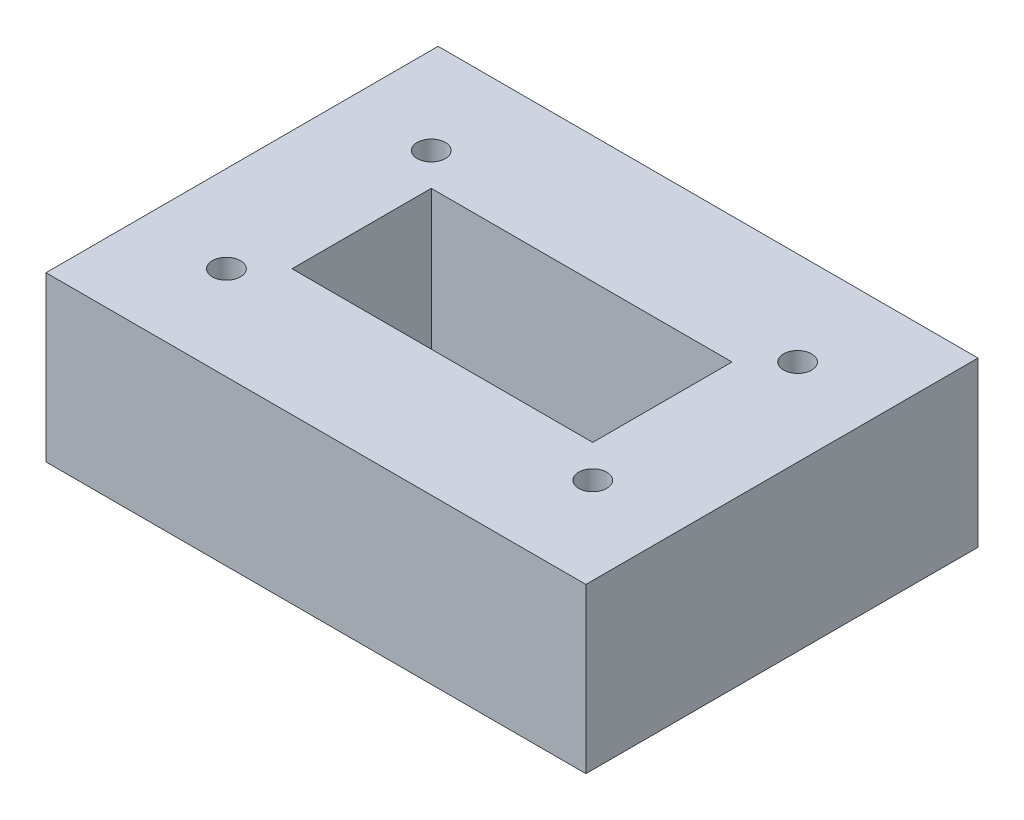
ISO-10303-21;
HEADER;
FILE_DESCRIPTION(('STEP AP214'),'2;1');
FILE_NAME('part.step','',(''),(''),'','','');
FILE_SCHEMA(('AUTOMOTIVE_DESIGN { 1 0 10303 214 1 1 1 1 }'));
ENDSEC;
DATA;
#1=APPLICATION_CONTEXT('core data for automotive mechanical design processes');
#2=APPLICATION_PROTOCOL_DEFINITION('international standard','automotive_design',2000,#1);
#3=PRODUCT_CONTEXT('',#1,'mechanical');
#4=PRODUCT('Part','Part','',(#3));
#5=PRODUCT_RELATED_PRODUCT_CATEGORY('part','',(#4));
#6=PRODUCT_DEFINITION_FORMATION('','',#4);
#7=PRODUCT_DEFINITION_CONTEXT('part definition',#1,'design');
#8=PRODUCT_DEFINITION('design','',#6,#7);
#9=PRODUCT_DEFINITION_SHAPE('','',#8);
#10=(LENGTH_UNIT() NAMED_UNIT(*) SI_UNIT(.MILLI.,.METRE.));
#11=(NAMED_UNIT(*) PLANE_ANGLE_UNIT() SI_UNIT($,.RADIAN.));
#12=(NAMED_UNIT(*) SI_UNIT($,.STERADIAN.) SOLID_ANGLE_UNIT());
#13=UNCERTAINTY_MEASURE_WITH_UNIT(LENGTH_MEASURE(1.E-05),#10,'distance_accuracy_value','');
#14=(GEOMETRIC_REPRESENTATION_CONTEXT(3) GLOBAL_UNCERTAINTY_ASSIGNED_CONTEXT((#13)) GLOBAL_UNIT_ASSIGNED_CONTEXT((#10,
#11,#12)) REPRESENTATION_CONTEXT('',''));
#15=CARTESIAN_POINT('',(0.,0.,0.));
#16=DIRECTION('',(0.,0.,1.));
#17=DIRECTION('',(1.,0.,0.));
#18=AXIS2_PLACEMENT_3D('',#15,#16,#17);
#19=CARTESIAN_POINT('',(-100.58,40.,-12.85));
#20=DIRECTION('',(0.,-1.,0.));
#21=DIRECTION('',(0.,0.,-1.));
#22=AXIS2_PLACEMENT_3D('',#19,#20,#21);
#23=CYLINDRICAL_SURFACE('',#22,3.43);
#24=CARTESIAN_POINT('',(-100.58,40.,-12.85));
#25=DIRECTION('',(0.,1.,0.));
#26=DIRECTION('',(0.,0.,1.));
#27=AXIS2_PLACEMENT_3D('',#24,#25,#26);
#28=CIRCLE('',#27,3.43);
#29=CARTESIAN_POINT('',(-100.58,40.,-9.41999999999997));
#30=VERTEX_POINT('',#29);
#31=EDGE_CURVE('E133',#30,#30,#28,.T.);
#32=ORIENTED_EDGE('',*,*,#31,.T.);
#33=EDGE_LOOP('',(#32));
#34=FACE_BOUND('',#33,.T.);
#35=CARTESIAN_POINT('',(-100.58,8.,-12.85));
#36=DIRECTION('',(0.,-1.,0.));
#37=DIRECTION('',(0.,0.,-1.));
#38=AXIS2_PLACEMENT_3D('',#35,#36,#37);
#39=CIRCLE('',#38,3.43);
#40=CARTESIAN_POINT('',(-100.58,8.,-16.28));
#41=VERTEX_POINT('',#40);
#42=EDGE_CURVE('E40',#41,#41,#39,.T.);
#43=ORIENTED_EDGE('',*,*,#42,.T.);
#44=EDGE_LOOP('',(#43));
#45=FACE_BOUND('',#44,.T.);
#46=ADVANCED_FACE('F36',(#34,#45),#23,.F.);
#47=CARTESIAN_POINT('',(-100.58,40.,-62.84));
#48=DIRECTION('',(0.,-1.,0.));
#49=DIRECTION('',(0.,0.,-1.));
#50=AXIS2_PLACEMENT_3D('',#47,#48,#49);
#51=CYLINDRICAL_SURFACE('',#50,3.43);
#52=CARTESIAN_POINT('',(-100.58,40.,-62.84));
#53=DIRECTION('',(0.,1.,0.));
#54=DIRECTION('',(0.,0.,1.));
#55=AXIS2_PLACEMENT_3D('',#52,#53,#54);
#56=CIRCLE('',#55,3.43);
#57=CARTESIAN_POINT('',(-100.58,40.,-59.41));
#58=VERTEX_POINT('',#57);
#59=EDGE_CURVE('E188',#58,#58,#56,.T.);
#60=ORIENTED_EDGE('',*,*,#59,.T.);
#61=EDGE_LOOP('',(#60));
#62=FACE_BOUND('',#61,.T.);
#63=CARTESIAN_POINT('',(-100.58,8.,-62.84));
#64=DIRECTION('',(0.,-1.,0.));
#65=DIRECTION('',(0.,0.,-1.));
#66=AXIS2_PLACEMENT_3D('',#63,#64,#65);
#67=CIRCLE('',#66,3.43);
#68=CARTESIAN_POINT('',(-100.58,8.,-66.27));
#69=VERTEX_POINT('',#68);
#70=EDGE_CURVE('E174',#69,#69,#67,.T.);
#71=ORIENTED_EDGE('',*,*,#70,.T.);
#72=EDGE_LOOP('',(#71));
#73=FACE_BOUND('',#72,.T.);
#74=ADVANCED_FACE('F244',(#62,#73),#51,.F.);
#75=CARTESIAN_POINT('',(-11.1800000000001,40.,-62.84));
#76=DIRECTION('',(0.,-1.,0.));
#77=DIRECTION('',(0.,0.,-1.));
#78=AXIS2_PLACEMENT_3D('',#75,#76,#77);
#79=CYLINDRICAL_SURFACE('',#78,3.43);
#80=CARTESIAN_POINT('',(-11.1800000000001,40.,-62.84));
#81=DIRECTION('',(0.,1.,0.));
#82=DIRECTION('',(0.,0.,1.));
#83=AXIS2_PLACEMENT_3D('',#80,#81,#82);
#84=CIRCLE('',#83,3.43);
#85=CARTESIAN_POINT('',(-11.1800000000001,40.,-59.41));
#86=VERTEX_POINT('',#85);
#87=EDGE_CURVE('E183',#86,#86,#84,.T.);
#88=ORIENTED_EDGE('',*,*,#87,.T.);
#89=EDGE_LOOP('',(#88));
#90=FACE_BOUND('',#89,.T.);
#91=CARTESIAN_POINT('',(-11.1800000000001,8.,-62.84));
#92=DIRECTION('',(0.,-1.,0.));
#93=DIRECTION('',(0.,0.,-1.));
#94=AXIS2_PLACEMENT_3D('',#91,#92,#93);
#95=CIRCLE('',#94,3.43);
#96=CARTESIAN_POINT('',(-11.1800000000001,8.,-66.27));
#97=VERTEX_POINT('',#96);
#98=EDGE_CURVE('E171',#97,#97,#95,.T.);
#99=ORIENTED_EDGE('',*,*,#98,.T.);
#100=EDGE_LOOP('',(#99));
#101=FACE_BOUND('',#100,.T.);
#102=ADVANCED_FACE('F248',(#90,#101),#79,.F.);
#103=CARTESIAN_POINT('',(-11.18,40.,-12.85));
#104=DIRECTION('',(0.,-1.,0.));
#105=DIRECTION('',(0.,0.,-1.));
#106=AXIS2_PLACEMENT_3D('',#103,#104,#105);
#107=CYLINDRICAL_SURFACE('',#106,3.43);
#108=CARTESIAN_POINT('',(-11.18,40.,-12.85));
#109=DIRECTION('',(0.,1.,0.));
#110=DIRECTION('',(0.,0.,1.));
#111=AXIS2_PLACEMENT_3D('',#108,#109,#110);
#112=CIRCLE('',#111,3.43);
#113=CARTESIAN_POINT('',(-11.18,40.,-9.41999999999998));
#114=VERTEX_POINT('',#113);
#115=EDGE_CURVE('E179',#114,#114,#112,.T.);
#116=ORIENTED_EDGE('',*,*,#115,.T.);
#117=EDGE_LOOP('',(#116));
#118=FACE_BOUND('',#117,.T.);
#119=CARTESIAN_POINT('',(-11.18,8.,-12.85));
#120=DIRECTION('',(0.,-1.,0.));
#121=DIRECTION('',(0.,0.,-1.));
#122=AXIS2_PLACEMENT_3D('',#119,#120,#121);
#123=CIRCLE('',#122,3.43);
#124=CARTESIAN_POINT('',(-11.18,8.,-16.28));
#125=VERTEX_POINT('',#124);
#126=EDGE_CURVE('E168',#125,#125,#123,.T.);
#127=ORIENTED_EDGE('',*,*,#126,.T.);
#128=EDGE_LOOP('',(#127));
#129=FACE_BOUND('',#128,.T.);
#130=ADVANCED_FACE('F202',(#118,#129),#107,.F.);
#131=CARTESIAN_POINT('',(0.,40.,0.));
#132=DIRECTION('',(0.,1.,0.));
#133=DIRECTION('',(0.,0.,1.));
#134=AXIS2_PLACEMENT_3D('',#131,#132,#133);
#135=PLANE('',#134);
#136=ORIENTED_EDGE('',*,*,#87,.F.);
#137=EDGE_LOOP('',(#136));
#138=FACE_BOUND('',#137,.T.);
#139=ORIENTED_EDGE('',*,*,#31,.F.);
#140=EDGE_LOOP('',(#139));
#141=FACE_BOUND('',#140,.T.);
#142=DIRECTION('',(0.,0.,1.));
#143=VECTOR('',#142,1.);
#144=CARTESIAN_POINT('',(-121.76,40.,-85.69));
#145=LINE('',#144,#143);
#146=CARTESIAN_POINT('',(-121.76,40.,-85.69));
#147=VERTEX_POINT('',#146);
#148=CARTESIAN_POINT('',(-121.76,40.,10.));
#149=VERTEX_POINT('',#148);
#150=EDGE_CURVE('E143',#147,#149,#145,.T.);
#151=ORIENTED_EDGE('',*,*,#150,.T.);
#152=DIRECTION('',(1.,0.,0.));
#153=VECTOR('',#152,1.);
#154=CARTESIAN_POINT('',(-121.76,40.,10.));
#155=LINE('',#154,#153);
#156=CARTESIAN_POINT('',(10.,40.,10.));
#157=VERTEX_POINT('',#156);
#158=EDGE_CURVE('E146',#149,#157,#155,.T.);
#159=ORIENTED_EDGE('',*,*,#158,.T.);
#160=DIRECTION('',(0.,0.,-1.));
#161=VECTOR('',#160,1.);
#162=CARTESIAN_POINT('',(10.,40.,-85.69));
#163=LINE('',#162,#161);
#164=CARTESIAN_POINT('',(10.,40.,-85.69));
#165=VERTEX_POINT('',#164);
#166=EDGE_CURVE('E149',#157,#165,#163,.T.);
#167=ORIENTED_EDGE('',*,*,#166,.T.);
#168=DIRECTION('',(-1.,0.,0.));
#169=VECTOR('',#168,1.);
#170=CARTESIAN_POINT('',(-121.76,40.,-85.69));
#171=LINE('',#170,#169);
#172=EDGE_CURVE('E151',#165,#147,#171,.T.);
#173=ORIENTED_EDGE('',*,*,#172,.T.);
#174=EDGE_LOOP('',(#151,#159,#167,#173));
#175=FACE_BOUND('',#174,.T.);
#176=DIRECTION('',(1.,0.,0.));
#177=VECTOR('',#176,1.);
#178=CARTESIAN_POINT('',(-92.58,40.,-20.85));
#179=LINE('',#178,#177);
#180=CARTESIAN_POINT('',(-92.58,40.,-20.85));
#181=VERTEX_POINT('',#180);
#182=CARTESIAN_POINT('',(-19.18,40.,-20.85));
#183=VERTEX_POINT('',#182);
#184=EDGE_CURVE('E111',#181,#183,#179,.T.);
#185=ORIENTED_EDGE('',*,*,#184,.F.);
#186=DIRECTION('',(0.,0.,1.));
#187=VECTOR('',#186,1.);
#188=CARTESIAN_POINT('',(-92.58,40.,-20.85));
#189=LINE('',#188,#187);
#190=CARTESIAN_POINT('',(-92.58,40.,-54.84));
#191=VERTEX_POINT('',#190);
#192=EDGE_CURVE('E103',#191,#181,#189,.T.);
#193=ORIENTED_EDGE('',*,*,#192,.F.);
#194=DIRECTION('',(-1.,0.,0.));
#195=VECTOR('',#194,1.);
#196=CARTESIAN_POINT('',(-92.58,40.,-54.84));
#197=LINE('',#196,#195);
#198=CARTESIAN_POINT('',(-19.18,40.,-54.84));
#199=VERTEX_POINT('',#198);
#200=EDGE_CURVE('E127',#199,#191,#197,.T.);
#201=ORIENTED_EDGE('',*,*,#200,.F.);
#202=DIRECTION('',(0.,0.,-1.));
#203=VECTOR('',#202,1.);
#204=CARTESIAN_POINT('',(-19.18,40.,-20.85));
#205=LINE('',#204,#203);
#206=EDGE_CURVE('E125',#183,#199,#205,.T.);
#207=ORIENTED_EDGE('',*,*,#206,.F.);
#208=EDGE_LOOP('',(#185,#193,#201,#207));
#209=FACE_BOUND('',#208,.T.);
#210=ORIENTED_EDGE('',*,*,#59,.F.);
#211=EDGE_LOOP('',(#210));
#212=FACE_BOUND('',#211,.T.);
#213=ORIENTED_EDGE('',*,*,#115,.F.);
#214=EDGE_LOOP('',(#213));
#215=FACE_BOUND('',#214,.T.);
#216=ADVANCED_FACE('F123',(#138,#141,#175,#209,#212,#215),#135,.T.);
#217=CARTESIAN_POINT('',(0.,0.,0.));
#218=DIRECTION('',(0.,1.,0.));
#219=DIRECTION('',(0.,0.,1.));
#220=AXIS2_PLACEMENT_3D('',#217,#218,#219);
#221=PLANE('',#220);
#222=CARTESIAN_POINT('',(-100.58,0.,-62.84));
#223=DIRECTION('',(0.,-1.,0.));
#224=DIRECTION('',(0.,0.,-1.));
#225=AXIS2_PLACEMENT_3D('',#222,#223,#224);
#226=CIRCLE('',#225,8.00000000000006);
#227=CARTESIAN_POINT('',(-100.58,0.,-70.8400000000001));
#228=VERTEX_POINT('',#227);
#229=EDGE_CURVE('E305',#228,#228,#226,.T.);
#230=ORIENTED_EDGE('',*,*,#229,.F.);
#231=EDGE_LOOP('',(#230));
#232=FACE_BOUND('',#231,.T.);
#233=CARTESIAN_POINT('',(-11.1800000000001,0.,-62.84));
#234=DIRECTION('',(0.,-1.,0.));
#235=DIRECTION('',(0.,0.,-1.));
#236=AXIS2_PLACEMENT_3D('',#233,#234,#235);
#237=CIRCLE('',#236,7.99999999999995);
#238=CARTESIAN_POINT('',(-11.1800000000001,0.,-70.84));
#239=VERTEX_POINT('',#238);
#240=EDGE_CURVE('E299',#239,#239,#237,.T.);
#241=ORIENTED_EDGE('',*,*,#240,.F.);
#242=EDGE_LOOP('',(#241));
#243=FACE_BOUND('',#242,.T.);
#244=CARTESIAN_POINT('',(-11.18,0.,-12.85));
#245=DIRECTION('',(0.,-1.,0.));
#246=DIRECTION('',(0.,0.,-1.));
#247=AXIS2_PLACEMENT_3D('',#244,#245,#246);
#248=CIRCLE('',#247,8.00000000000002);
#249=CARTESIAN_POINT('',(-11.18,0.,-20.85));
#250=VERTEX_POINT('',#249);
#251=EDGE_CURVE('E290',#250,#250,#248,.T.);
#252=ORIENTED_EDGE('',*,*,#251,.F.);
#253=EDGE_LOOP('',(#252));
#254=FACE_BOUND('',#253,.T.);
#255=CARTESIAN_POINT('',(-100.58,0.,-12.85));
#256=DIRECTION('',(0.,-1.,0.));
#257=DIRECTION('',(0.,0.,-1.));
#258=AXIS2_PLACEMENT_3D('',#255,#256,#257);
#259=CIRCLE('',#258,8.00000000000001);
#260=CARTESIAN_POINT('',(-100.58,0.,-20.85));
#261=VERTEX_POINT('',#260);
#262=EDGE_CURVE('E191',#261,#261,#259,.T.);
#263=ORIENTED_EDGE('',*,*,#262,.F.);
#264=EDGE_LOOP('',(#263));
#265=FACE_BOUND('',#264,.T.);
#266=DIRECTION('',(0.,0.,1.));
#267=VECTOR('',#266,1.);
#268=CARTESIAN_POINT('',(-121.76,0.,-85.69));
#269=LINE('',#268,#267);
#270=CARTESIAN_POINT('',(-121.76,0.,-85.69));
#271=VERTEX_POINT('',#270);
#272=CARTESIAN_POINT('',(-121.76,0.,10.));
#273=VERTEX_POINT('',#272);
#274=EDGE_CURVE('E119',#271,#273,#269,.T.);
#275=ORIENTED_EDGE('',*,*,#274,.F.);
#276=DIRECTION('',(-1.,0.,0.));
#277=VECTOR('',#276,1.);
#278=CARTESIAN_POINT('',(-121.76,0.,-85.69));
#279=LINE('',#278,#277);
#280=CARTESIAN_POINT('',(10.,0.,-85.69));
#281=VERTEX_POINT('',#280);
#282=EDGE_CURVE('E147',#281,#271,#279,.T.);
#283=ORIENTED_EDGE('',*,*,#282,.F.);
#284=DIRECTION('',(0.,0.,-1.));
#285=VECTOR('',#284,1.);
#286=CARTESIAN_POINT('',(10.,0.,-85.69));
#287=LINE('',#286,#285);
#288=CARTESIAN_POINT('',(10.,0.,10.));
#289=VERTEX_POINT('',#288);
#290=EDGE_CURVE('E158',#289,#281,#287,.T.);
#291=ORIENTED_EDGE('',*,*,#290,.F.);
#292=DIRECTION('',(1.,0.,0.));
#293=VECTOR('',#292,1.);
#294=CARTESIAN_POINT('',(-121.76,0.,10.));
#295=LINE('',#294,#293);
#296=EDGE_CURVE('E156',#273,#289,#295,.T.);
#297=ORIENTED_EDGE('',*,*,#296,.F.);
#298=EDGE_LOOP('',(#275,#283,#291,#297));
#299=FACE_BOUND('',#298,.T.);
#300=DIRECTION('',(0.,0.,1.));
#301=VECTOR('',#300,1.);
#302=CARTESIAN_POINT('',(-92.58,0.,-20.85));
#303=LINE('',#302,#301);
#304=CARTESIAN_POINT('',(-92.58,0.,-54.84));
#305=VERTEX_POINT('',#304);
#306=CARTESIAN_POINT('',(-92.58,0.,-20.85));
#307=VERTEX_POINT('',#306);
#308=EDGE_CURVE('E61',#305,#307,#303,.T.);
#309=ORIENTED_EDGE('',*,*,#308,.T.);
#310=DIRECTION('',(1.,0.,0.));
#311=VECTOR('',#310,1.);
#312=CARTESIAN_POINT('',(-92.58,0.,-20.85));
#313=LINE('',#312,#311);
#314=CARTESIAN_POINT('',(-19.18,0.,-20.85));
#315=VERTEX_POINT('',#314);
#316=EDGE_CURVE('E118',#307,#315,#313,.T.);
#317=ORIENTED_EDGE('',*,*,#316,.T.);
#318=DIRECTION('',(0.,0.,-1.));
#319=VECTOR('',#318,1.);
#320=CARTESIAN_POINT('',(-19.18,0.,-20.85));
#321=LINE('',#320,#319);
#322=CARTESIAN_POINT('',(-19.18,0.,-54.84));
#323=VERTEX_POINT('',#322);
#324=EDGE_CURVE('E135',#315,#323,#321,.T.);
#325=ORIENTED_EDGE('',*,*,#324,.T.);
#326=DIRECTION('',(-1.,0.,0.));
#327=VECTOR('',#326,1.);
#328=CARTESIAN_POINT('',(-92.58,0.,-54.84));
#329=LINE('',#328,#327);
#330=EDGE_CURVE('E112',#323,#305,#329,.T.);
#331=ORIENTED_EDGE('',*,*,#330,.T.);
#332=EDGE_LOOP('',(#309,#317,#325,#331));
#333=FACE_BOUND('',#332,.T.);
#334=ADVANCED_FACE('F201',(#232,#243,#254,#265,#299,#333),#221,.F.);
#335=CARTESIAN_POINT('',(-121.76,40.,-85.69));
#336=DIRECTION('',(1.,0.,0.));
#337=DIRECTION('',(0.,0.,-1.));
#338=AXIS2_PLACEMENT_3D('',#335,#336,#337);
#339=PLANE('',#338);
#340=ORIENTED_EDGE('',*,*,#274,.T.);
#341=DIRECTION('',(0.,-1.,0.));
#342=VECTOR('',#341,1.);
#343=CARTESIAN_POINT('',(-121.76,40.,10.));
#344=LINE('',#343,#342);
#345=EDGE_CURVE('E11',#149,#273,#344,.T.);
#346=ORIENTED_EDGE('',*,*,#345,.F.);
#347=ORIENTED_EDGE('',*,*,#150,.F.);
#348=DIRECTION('',(0.,-1.,0.));
#349=VECTOR('',#348,1.);
#350=CARTESIAN_POINT('',(-121.76,40.,-85.69));
#351=LINE('',#350,#349);
#352=EDGE_CURVE('E153',#147,#271,#351,.T.);
#353=ORIENTED_EDGE('',*,*,#352,.T.);
#354=EDGE_LOOP('',(#340,#346,#347,#353));
#355=FACE_BOUND('',#354,.T.);
#356=ADVANCED_FACE('F38',(#355),#339,.F.);
#357=CARTESIAN_POINT('',(-121.76,40.,10.));
#358=DIRECTION('',(0.,0.,-1.));
#359=DIRECTION('',(-1.,0.,0.));
#360=AXIS2_PLACEMENT_3D('',#357,#358,#359);
#361=PLANE('',#360);
#362=ORIENTED_EDGE('',*,*,#296,.T.);
#363=DIRECTION('',(0.,-1.,0.));
#364=VECTOR('',#363,1.);
#365=CARTESIAN_POINT('',(10.,40.,10.));
#366=LINE('',#365,#364);
#367=EDGE_CURVE('E45',#157,#289,#366,.T.);
#368=ORIENTED_EDGE('',*,*,#367,.F.);
#369=ORIENTED_EDGE('',*,*,#158,.F.);
#370=ORIENTED_EDGE('',*,*,#345,.T.);
#371=EDGE_LOOP('',(#362,#368,#369,#370));
#372=FACE_BOUND('',#371,.T.);
#373=ADVANCED_FACE('F213',(#372),#361,.F.);
#374=CARTESIAN_POINT('',(10.,40.,-85.69));
#375=DIRECTION('',(-1.,0.,0.));
#376=DIRECTION('',(0.,0.,1.));
#377=AXIS2_PLACEMENT_3D('',#374,#375,#376);
#378=PLANE('',#377);
#379=ORIENTED_EDGE('',*,*,#290,.T.);
#380=DIRECTION('',(0.,-1.,0.));
#381=VECTOR('',#380,1.);
#382=CARTESIAN_POINT('',(10.,40.,-85.69));
#383=LINE('',#382,#381);
#384=EDGE_CURVE('E163',#165,#281,#383,.T.);
#385=ORIENTED_EDGE('',*,*,#384,.F.);
#386=ORIENTED_EDGE('',*,*,#166,.F.);
#387=ORIENTED_EDGE('',*,*,#367,.T.);
#388=EDGE_LOOP('',(#379,#385,#386,#387));
#389=FACE_BOUND('',#388,.T.);
#390=ADVANCED_FACE('F218',(#389),#378,.F.);
#391=CARTESIAN_POINT('',(-121.76,40.,-85.69));
#392=DIRECTION('',(0.,0.,1.));
#393=DIRECTION('',(1.,0.,0.));
#394=AXIS2_PLACEMENT_3D('',#391,#392,#393);
#395=PLANE('',#394);
#396=ORIENTED_EDGE('',*,*,#282,.T.);
#397=ORIENTED_EDGE('',*,*,#352,.F.);
#398=ORIENTED_EDGE('',*,*,#172,.F.);
#399=ORIENTED_EDGE('',*,*,#384,.T.);
#400=EDGE_LOOP('',(#396,#397,#398,#399));
#401=FACE_BOUND('',#400,.T.);
#402=ADVANCED_FACE('F221',(#401),#395,.F.);
#403=CARTESIAN_POINT('',(-92.58,40.,-20.85));
#404=DIRECTION('',(1.,0.,0.));
#405=DIRECTION('',(0.,0.,-1.));
#406=AXIS2_PLACEMENT_3D('',#403,#404,#405);
#407=PLANE('',#406);
#408=ORIENTED_EDGE('',*,*,#308,.F.);
#409=DIRECTION('',(0.,-1.,0.));
#410=VECTOR('',#409,1.);
#411=CARTESIAN_POINT('',(-92.58,40.,-54.84));
#412=LINE('',#411,#410);
#413=EDGE_CURVE('E107',#191,#305,#412,.T.);
#414=ORIENTED_EDGE('',*,*,#413,.F.);
#415=ORIENTED_EDGE('',*,*,#192,.T.);
#416=DIRECTION('',(0.,-1.,0.));
#417=VECTOR('',#416,1.);
#418=CARTESIAN_POINT('',(-92.58,40.,-20.85));
#419=LINE('',#418,#417);
#420=EDGE_CURVE('E106',#181,#307,#419,.T.);
#421=ORIENTED_EDGE('',*,*,#420,.T.);
#422=EDGE_LOOP('',(#408,#414,#415,#421));
#423=FACE_BOUND('',#422,.T.);
#424=ADVANCED_FACE('F105',(#423),#407,.T.);
#425=CARTESIAN_POINT('',(-92.58,40.,-20.85));
#426=DIRECTION('',(0.,0.,-1.));
#427=DIRECTION('',(-1.,0.,0.));
#428=AXIS2_PLACEMENT_3D('',#425,#426,#427);
#429=PLANE('',#428);
#430=ORIENTED_EDGE('',*,*,#316,.F.);
#431=ORIENTED_EDGE('',*,*,#420,.F.);
#432=ORIENTED_EDGE('',*,*,#184,.T.);
#433=DIRECTION('',(0.,-1.,0.));
#434=VECTOR('',#433,1.);
#435=CARTESIAN_POINT('',(-19.18,40.,-20.85));
#436=LINE('',#435,#434);
#437=EDGE_CURVE('E120',#183,#315,#436,.T.);
#438=ORIENTED_EDGE('',*,*,#437,.T.);
#439=EDGE_LOOP('',(#430,#431,#432,#438));
#440=FACE_BOUND('',#439,.T.);
#441=ADVANCED_FACE('F115',(#440),#429,.T.);
#442=CARTESIAN_POINT('',(-19.18,40.,-20.85));
#443=DIRECTION('',(-1.,0.,0.));
#444=DIRECTION('',(0.,0.,1.));
#445=AXIS2_PLACEMENT_3D('',#442,#443,#444);
#446=PLANE('',#445);
#447=ORIENTED_EDGE('',*,*,#324,.F.);
#448=ORIENTED_EDGE('',*,*,#437,.F.);
#449=ORIENTED_EDGE('',*,*,#206,.T.);
#450=DIRECTION('',(0.,-1.,0.));
#451=VECTOR('',#450,1.);
#452=CARTESIAN_POINT('',(-19.18,40.,-54.84));
#453=LINE('',#452,#451);
#454=EDGE_CURVE('E53',#199,#323,#453,.T.);
#455=ORIENTED_EDGE('',*,*,#454,.T.);
#456=EDGE_LOOP('',(#447,#448,#449,#455));
#457=FACE_BOUND('',#456,.T.);
#458=ADVANCED_FACE('F231',(#457),#446,.T.);
#459=CARTESIAN_POINT('',(-92.58,40.,-54.84));
#460=DIRECTION('',(0.,0.,1.));
#461=DIRECTION('',(1.,0.,0.));
#462=AXIS2_PLACEMENT_3D('',#459,#460,#461);
#463=PLANE('',#462);
#464=ORIENTED_EDGE('',*,*,#330,.F.);
#465=ORIENTED_EDGE('',*,*,#454,.F.);
#466=ORIENTED_EDGE('',*,*,#200,.T.);
#467=ORIENTED_EDGE('',*,*,#413,.T.);
#468=EDGE_LOOP('',(#464,#465,#466,#467));
#469=FACE_BOUND('',#468,.T.);
#470=ADVANCED_FACE('F228',(#469),#463,.T.);
#471=CARTESIAN_POINT('',(-11.18,8.,-12.85));
#472=DIRECTION('',(0.,-1.,0.));
#473=DIRECTION('',(0.,0.,-1.));
#474=AXIS2_PLACEMENT_3D('',#471,#472,#473);
#475=CYLINDRICAL_SURFACE('',#474,8.00000000000002);
#476=CARTESIAN_POINT('',(-11.18,8.,-12.85));
#477=DIRECTION('',(0.,-1.,0.));
#478=DIRECTION('',(0.,0.,-1.));
#479=AXIS2_PLACEMENT_3D('',#476,#477,#478);
#480=CIRCLE('',#479,8.00000000000002);
#481=CARTESIAN_POINT('',(-11.18,8.,-20.85));
#482=VERTEX_POINT('',#481);
#483=EDGE_CURVE('E289',#482,#482,#480,.T.);
#484=ORIENTED_EDGE('',*,*,#483,.F.);
#485=EDGE_LOOP('',(#484));
#486=FACE_BOUND('',#485,.T.);
#487=ORIENTED_EDGE('',*,*,#251,.T.);
#488=EDGE_LOOP('',(#487));
#489=FACE_BOUND('',#488,.T.);
#490=ADVANCED_FACE('F230',(#486,#489),#475,.F.);
#491=CARTESIAN_POINT('',(-11.18,8.,-12.85));
#492=DIRECTION('',(0.,-1.,0.));
#493=DIRECTION('',(0.,0.,-1.));
#494=AXIS2_PLACEMENT_3D('',#491,#492,#493);
#495=PLANE('',#494);
#496=ORIENTED_EDGE('',*,*,#126,.F.);
#497=EDGE_LOOP('',(#496));
#498=FACE_BOUND('',#497,.T.);
#499=ORIENTED_EDGE('',*,*,#483,.T.);
#500=EDGE_LOOP('',(#499));
#501=FACE_BOUND('',#500,.T.);
#502=ADVANCED_FACE('F237',(#498,#501),#495,.T.);
#503=CARTESIAN_POINT('',(-11.1800000000001,8.,-62.84));
#504=DIRECTION('',(0.,-1.,0.));
#505=DIRECTION('',(0.,0.,-1.));
#506=AXIS2_PLACEMENT_3D('',#503,#504,#505);
#507=CYLINDRICAL_SURFACE('',#506,7.99999999999995);
#508=CARTESIAN_POINT('',(-11.1800000000001,8.,-62.84));
#509=DIRECTION('',(0.,-1.,0.));
#510=DIRECTION('',(0.,0.,-1.));
#511=AXIS2_PLACEMENT_3D('',#508,#509,#510);
#512=CIRCLE('',#511,7.99999999999995);
#513=CARTESIAN_POINT('',(-11.1800000000001,8.,-70.84));
#514=VERTEX_POINT('',#513);
#515=EDGE_CURVE('E294',#514,#514,#512,.T.);
#516=ORIENTED_EDGE('',*,*,#515,.F.);
#517=EDGE_LOOP('',(#516));
#518=FACE_BOUND('',#517,.T.);
#519=ORIENTED_EDGE('',*,*,#240,.T.);
#520=EDGE_LOOP('',(#519));
#521=FACE_BOUND('',#520,.T.);
#522=ADVANCED_FACE('F274',(#518,#521),#507,.F.);
#523=CARTESIAN_POINT('',(-11.1800000000001,8.,-62.84));
#524=DIRECTION('',(0.,-1.,0.));
#525=DIRECTION('',(0.,0.,-1.));
#526=AXIS2_PLACEMENT_3D('',#523,#524,#525);
#527=PLANE('',#526);
#528=ORIENTED_EDGE('',*,*,#98,.F.);
#529=EDGE_LOOP('',(#528));
#530=FACE_BOUND('',#529,.T.);
#531=ORIENTED_EDGE('',*,*,#515,.T.);
#532=EDGE_LOOP('',(#531));
#533=FACE_BOUND('',#532,.T.);
#534=ADVANCED_FACE('F269',(#530,#533),#527,.T.);
#535=CARTESIAN_POINT('',(-100.58,8.,-62.84));
#536=DIRECTION('',(0.,-1.,0.));
#537=DIRECTION('',(0.,0.,-1.));
#538=AXIS2_PLACEMENT_3D('',#535,#536,#537);
#539=CYLINDRICAL_SURFACE('',#538,8.00000000000006);
#540=CARTESIAN_POINT('',(-100.58,8.,-62.84));
#541=DIRECTION('',(0.,-1.,0.));
#542=DIRECTION('',(0.,0.,-1.));
#543=AXIS2_PLACEMENT_3D('',#540,#541,#542);
#544=CIRCLE('',#543,8.00000000000006);
#545=CARTESIAN_POINT('',(-100.58,8.,-70.8400000000001));
#546=VERTEX_POINT('',#545);
#547=EDGE_CURVE('E302',#546,#546,#544,.T.);
#548=ORIENTED_EDGE('',*,*,#547,.F.);
#549=EDGE_LOOP('',(#548));
#550=FACE_BOUND('',#549,.T.);
#551=ORIENTED_EDGE('',*,*,#229,.T.);
#552=EDGE_LOOP('',(#551));
#553=FACE_BOUND('',#552,.T.);
#554=ADVANCED_FACE('F266',(#550,#553),#539,.F.);
#555=CARTESIAN_POINT('',(-100.58,8.,-62.84));
#556=DIRECTION('',(0.,-1.,0.));
#557=DIRECTION('',(0.,0.,-1.));
#558=AXIS2_PLACEMENT_3D('',#555,#556,#557);
#559=PLANE('',#558);
#560=ORIENTED_EDGE('',*,*,#70,.F.);
#561=EDGE_LOOP('',(#560));
#562=FACE_BOUND('',#561,.T.);
#563=ORIENTED_EDGE('',*,*,#547,.T.);
#564=EDGE_LOOP('',(#563));
#565=FACE_BOUND('',#564,.T.);
#566=ADVANCED_FACE('F261',(#562,#565),#559,.T.);
#567=CARTESIAN_POINT('',(-100.58,8.,-12.85));
#568=DIRECTION('',(0.,-1.,0.));
#569=DIRECTION('',(0.,0.,-1.));
#570=AXIS2_PLACEMENT_3D('',#567,#568,#569);
#571=CYLINDRICAL_SURFACE('',#570,8.00000000000001);
#572=CARTESIAN_POINT('',(-100.58,8.,-12.85));
#573=DIRECTION('',(0.,-1.,0.));
#574=DIRECTION('',(0.,0.,-1.));
#575=AXIS2_PLACEMENT_3D('',#572,#573,#574);
#576=CIRCLE('',#575,8.00000000000001);
#577=CARTESIAN_POINT('',(-100.58,8.,-20.85));
#578=VERTEX_POINT('',#577);
#579=EDGE_CURVE('E172',#578,#578,#576,.T.);
#580=ORIENTED_EDGE('',*,*,#579,.F.);
#581=EDGE_LOOP('',(#580));
#582=FACE_BOUND('',#581,.T.);
#583=ORIENTED_EDGE('',*,*,#262,.T.);
#584=EDGE_LOOP('',(#583));
#585=FACE_BOUND('',#584,.T.);
#586=ADVANCED_FACE('F257',(#582,#585),#571,.F.);
#587=CARTESIAN_POINT('',(-100.58,8.,-12.85));
#588=DIRECTION('',(0.,-1.,0.));
#589=DIRECTION('',(0.,0.,-1.));
#590=AXIS2_PLACEMENT_3D('',#587,#588,#589);
#591=PLANE('',#590);
#592=ORIENTED_EDGE('',*,*,#42,.F.);
#593=EDGE_LOOP('',(#592));
#594=FACE_BOUND('',#593,.T.);
#595=ORIENTED_EDGE('',*,*,#579,.T.);
#596=EDGE_LOOP('',(#595));
#597=FACE_BOUND('',#596,.T.);
#598=ADVANCED_FACE('F260',(#594,#597),#591,.T.);
#599=CLOSED_SHELL('',(#46,#74,#102,#130,#216,#334,#356,#373,#390,#402,#424,#441,#458,#470,#490,
#502,#522,#534,#554,#566,#586,#598));
#600=MANIFOLD_SOLID_BREP('B2',#599);
#601=ADVANCED_BREP_SHAPE_REPRESENTATION('',(#18,#600),#14);
#602=SHAPE_DEFINITION_REPRESENTATION(#9,#601);
ENDSEC;
END-ISO-10303-21;
